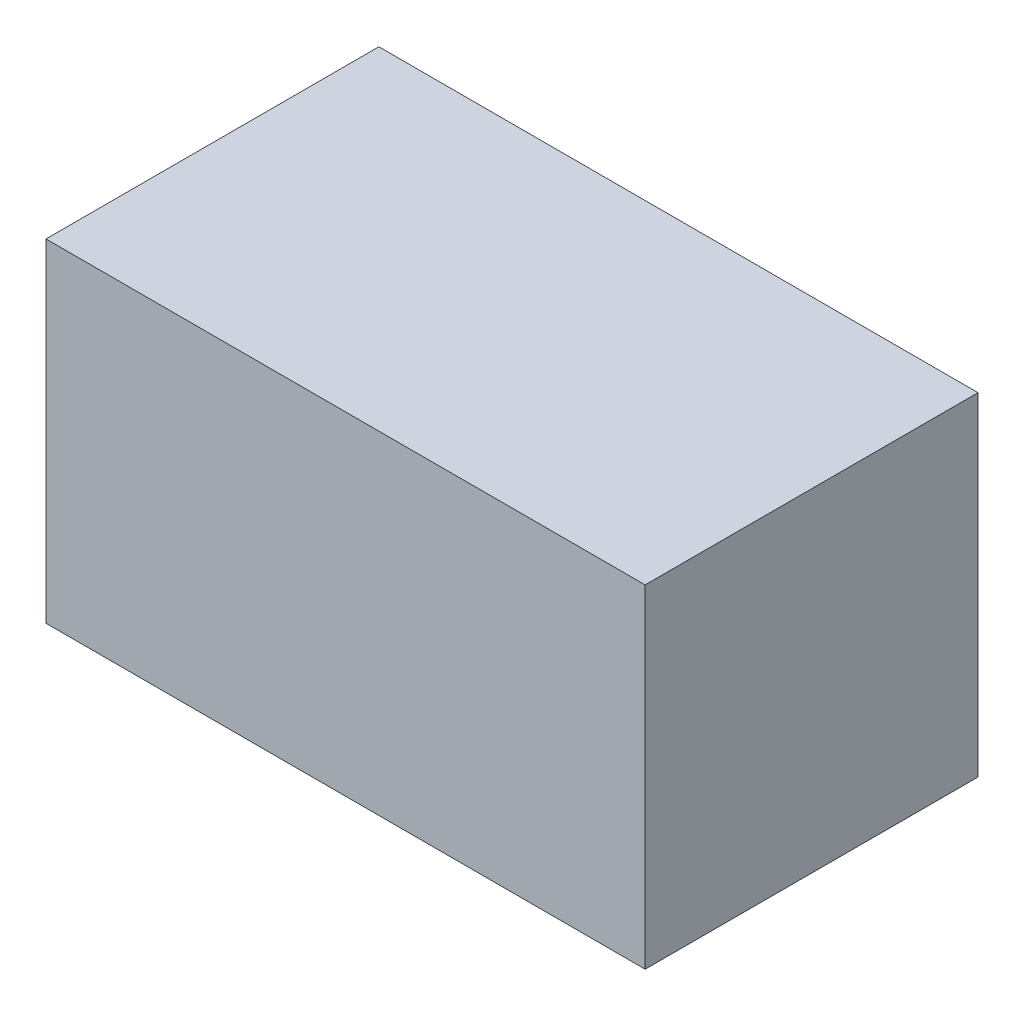
ISO-10303-21;
HEADER;
FILE_DESCRIPTION(('STEP AP214'),'2;1');
FILE_NAME('part.step','',(''),(''),'','','');
FILE_SCHEMA(('AUTOMOTIVE_DESIGN { 1 0 10303 214 1 1 1 1 }'));
ENDSEC;
DATA;
#1=APPLICATION_CONTEXT('core data for automotive mechanical design processes');
#2=APPLICATION_PROTOCOL_DEFINITION('international standard','automotive_design',2000,#1);
#3=PRODUCT_CONTEXT('',#1,'mechanical');
#4=PRODUCT('Part','Part','',(#3));
#5=PRODUCT_RELATED_PRODUCT_CATEGORY('part','',(#4));
#6=PRODUCT_DEFINITION_FORMATION('','',#4);
#7=PRODUCT_DEFINITION_CONTEXT('part definition',#1,'design');
#8=PRODUCT_DEFINITION('design','',#6,#7);
#9=PRODUCT_DEFINITION_SHAPE('','',#8);
#10=(LENGTH_UNIT() NAMED_UNIT(*) SI_UNIT(.MILLI.,.METRE.));
#11=(NAMED_UNIT(*) PLANE_ANGLE_UNIT() SI_UNIT($,.RADIAN.));
#12=(NAMED_UNIT(*) SI_UNIT($,.STERADIAN.) SOLID_ANGLE_UNIT());
#13=UNCERTAINTY_MEASURE_WITH_UNIT(LENGTH_MEASURE(1.E-05),#10,'distance_accuracy_value','');
#14=(GEOMETRIC_REPRESENTATION_CONTEXT(3) GLOBAL_UNCERTAINTY_ASSIGNED_CONTEXT((#13)) GLOBAL_UNIT_ASSIGNED_CONTEXT((#10,
#11,#12)) REPRESENTATION_CONTEXT('',''));
#15=CARTESIAN_POINT('',(0.,0.,0.));
#16=DIRECTION('',(0.,0.,1.));
#17=DIRECTION('',(1.,0.,0.));
#18=AXIS2_PLACEMENT_3D('',#15,#16,#17);
#19=CARTESIAN_POINT('',(0.4499991,0.2499995,0.));
#20=DIRECTION('',(0.,-1.,0.));
#21=DIRECTION('',(0.,0.,-1.));
#22=AXIS2_PLACEMENT_3D('',#19,#20,#21);
#23=PLANE('',#22);
#24=DIRECTION('',(0.,0.,-1.));
#25=VECTOR('',#24,1.);
#26=CARTESIAN_POINT('',(-0.44999656,0.2499995,0.));
#27=LINE('',#26,#25);
#28=CARTESIAN_POINT('',(-0.44999656,0.2499995,0.));
#29=VERTEX_POINT('',#28);
#30=CARTESIAN_POINT('',(-0.44999656,0.2499995,0.499999));
#31=VERTEX_POINT('',#30);
#32=EDGE_CURVE('E20',#29,#31,#27,.F.);
#33=ORIENTED_EDGE('',*,*,#32,.T.);
#34=DIRECTION('',(-1.,0.,0.));
#35=VECTOR('',#34,1.);
#36=CARTESIAN_POINT('',(-0.44999656,0.2499995,0.499999));
#37=LINE('',#36,#35);
#38=CARTESIAN_POINT('',(0.4499991,0.2499995,0.499999));
#39=VERTEX_POINT('',#38);
#40=EDGE_CURVE('E55',#31,#39,#37,.F.);
#41=ORIENTED_EDGE('',*,*,#40,.T.);
#42=DIRECTION('',(0.,0.,1.));
#43=VECTOR('',#42,1.);
#44=CARTESIAN_POINT('',(0.4499991,0.2499995,0.));
#45=LINE('',#44,#43);
#46=CARTESIAN_POINT('',(0.4499991,0.2499995,0.));
#47=VERTEX_POINT('',#46);
#48=EDGE_CURVE('E76',#39,#47,#45,.F.);
#49=ORIENTED_EDGE('',*,*,#48,.T.);
#50=DIRECTION('',(-1.,0.,0.));
#51=VECTOR('',#50,1.);
#52=CARTESIAN_POINT('',(-0.44999656,0.2499995,0.));
#53=LINE('',#52,#51);
#54=EDGE_CURVE('E58',#29,#47,#53,.F.);
#55=ORIENTED_EDGE('',*,*,#54,.F.);
#56=EDGE_LOOP('',(#33,#41,#49,#55));
#57=FACE_BOUND('',#56,.T.);
#58=ADVANCED_FACE('F17',(#57),#23,.F.);
#59=CARTESIAN_POINT('',(-0.44999656,0.2499995,0.));
#60=DIRECTION('',(1.,0.,0.));
#61=DIRECTION('',(0.,0.,-1.));
#62=AXIS2_PLACEMENT_3D('',#59,#60,#61);
#63=PLANE('',#62);
#64=DIRECTION('',(0.,0.,1.));
#65=VECTOR('',#64,1.);
#66=CARTESIAN_POINT('',(-0.44999656,-0.2499995,0.));
#67=LINE('',#66,#65);
#68=CARTESIAN_POINT('',(-0.44999656,-0.2499995,0.));
#69=VERTEX_POINT('',#68);
#70=CARTESIAN_POINT('',(-0.44999656,-0.2499995,0.499999));
#71=VERTEX_POINT('',#70);
#72=EDGE_CURVE('E73',#69,#71,#67,.T.);
#73=ORIENTED_EDGE('',*,*,#72,.T.);
#74=DIRECTION('',(0.,1.,0.));
#75=VECTOR('',#74,1.);
#76=CARTESIAN_POINT('',(-0.44999656,-0.2499995,0.499999));
#77=LINE('',#76,#75);
#78=EDGE_CURVE('E63',#71,#31,#77,.T.);
#79=ORIENTED_EDGE('',*,*,#78,.T.);
#80=ORIENTED_EDGE('',*,*,#32,.F.);
#81=DIRECTION('',(0.,1.,0.));
#82=VECTOR('',#81,1.);
#83=CARTESIAN_POINT('',(-0.44999656,-0.2499995,0.));
#84=LINE('',#83,#82);
#85=EDGE_CURVE('E78',#69,#29,#84,.T.);
#86=ORIENTED_EDGE('',*,*,#85,.F.);
#87=EDGE_LOOP('',(#73,#79,#80,#86));
#88=FACE_BOUND('',#87,.T.);
#89=ADVANCED_FACE('F72',(#88),#63,.F.);
#90=CARTESIAN_POINT('',(-0.44999656,-0.2499995,0.499999));
#91=DIRECTION('',(0.,0.,-1.));
#92=DIRECTION('',(-1.,0.,0.));
#93=AXIS2_PLACEMENT_3D('',#90,#91,#92);
#94=PLANE('',#93);
#95=DIRECTION('',(0.,1.,0.));
#96=VECTOR('',#95,1.);
#97=CARTESIAN_POINT('',(0.4499991,-0.2499995,0.499999));
#98=LINE('',#97,#96);
#99=CARTESIAN_POINT('',(0.4499991,-0.2499995,0.499999));
#100=VERTEX_POINT('',#99);
#101=EDGE_CURVE('E69',#100,#39,#98,.T.);
#102=ORIENTED_EDGE('',*,*,#101,.T.);
#103=ORIENTED_EDGE('',*,*,#40,.F.);
#104=ORIENTED_EDGE('',*,*,#78,.F.);
#105=DIRECTION('',(1.,0.,0.));
#106=VECTOR('',#105,1.);
#107=CARTESIAN_POINT('',(-0.44999656,-0.2499995,0.499999));
#108=LINE('',#107,#106);
#109=EDGE_CURVE('E83',#71,#100,#108,.T.);
#110=ORIENTED_EDGE('',*,*,#109,.T.);
#111=EDGE_LOOP('',(#102,#103,#104,#110));
#112=FACE_BOUND('',#111,.T.);
#113=ADVANCED_FACE('F66',(#112),#94,.F.);
#114=CARTESIAN_POINT('',(0.4499991,-0.2499995,0.));
#115=DIRECTION('',(-1.,0.,0.));
#116=DIRECTION('',(0.,0.,1.));
#117=AXIS2_PLACEMENT_3D('',#114,#115,#116);
#118=PLANE('',#117);
#119=ORIENTED_EDGE('',*,*,#48,.F.);
#120=ORIENTED_EDGE('',*,*,#101,.F.);
#121=DIRECTION('',(0.,0.,1.));
#122=VECTOR('',#121,1.);
#123=CARTESIAN_POINT('',(0.4499991,-0.2499995,0.));
#124=LINE('',#123,#122);
#125=CARTESIAN_POINT('',(0.4499991,-0.2499995,0.));
#126=VERTEX_POINT('',#125);
#127=EDGE_CURVE('E26',#100,#126,#124,.F.);
#128=ORIENTED_EDGE('',*,*,#127,.T.);
#129=DIRECTION('',(0.,1.,0.));
#130=VECTOR('',#129,1.);
#131=CARTESIAN_POINT('',(0.4499991,-0.2499995,0.));
#132=LINE('',#131,#130);
#133=EDGE_CURVE('E34',#47,#126,#132,.F.);
#134=ORIENTED_EDGE('',*,*,#133,.F.);
#135=EDGE_LOOP('',(#119,#120,#128,#134));
#136=FACE_BOUND('',#135,.T.);
#137=ADVANCED_FACE('F88',(#136),#118,.F.);
#138=CARTESIAN_POINT('',(-0.44999656,-0.2499995,0.));
#139=DIRECTION('',(0.,0.,-1.));
#140=DIRECTION('',(-1.,0.,0.));
#141=AXIS2_PLACEMENT_3D('',#138,#139,#140);
#142=PLANE('',#141);
#143=ORIENTED_EDGE('',*,*,#133,.T.);
#144=DIRECTION('',(1.,0.,0.));
#145=VECTOR('',#144,1.);
#146=CARTESIAN_POINT('',(-0.44999656,-0.2499995,0.));
#147=LINE('',#146,#145);
#148=EDGE_CURVE('E11',#126,#69,#147,.F.);
#149=ORIENTED_EDGE('',*,*,#148,.T.);
#150=ORIENTED_EDGE('',*,*,#85,.T.);
#151=ORIENTED_EDGE('',*,*,#54,.T.);
#152=EDGE_LOOP('',(#143,#149,#150,#151));
#153=FACE_BOUND('',#152,.T.);
#154=ADVANCED_FACE('F91',(#153),#142,.T.);
#155=CARTESIAN_POINT('',(-0.44999656,-0.2499995,0.));
#156=DIRECTION('',(0.,1.,0.));
#157=DIRECTION('',(0.,0.,1.));
#158=AXIS2_PLACEMENT_3D('',#155,#156,#157);
#159=PLANE('',#158);
#160=ORIENTED_EDGE('',*,*,#127,.F.);
#161=ORIENTED_EDGE('',*,*,#109,.F.);
#162=ORIENTED_EDGE('',*,*,#72,.F.);
#163=ORIENTED_EDGE('',*,*,#148,.F.);
#164=EDGE_LOOP('',(#160,#161,#162,#163));
#165=FACE_BOUND('',#164,.T.);
#166=ADVANCED_FACE('F90',(#165),#159,.F.);
#167=CLOSED_SHELL('',(#58,#89,#113,#137,#154,#166));
#168=MANIFOLD_SOLID_BREP('B1',#167);
#169=ADVANCED_BREP_SHAPE_REPRESENTATION('',(#18,#168),#14);
#170=SHAPE_DEFINITION_REPRESENTATION(#9,#169);
ENDSEC;
END-ISO-10303-21;
